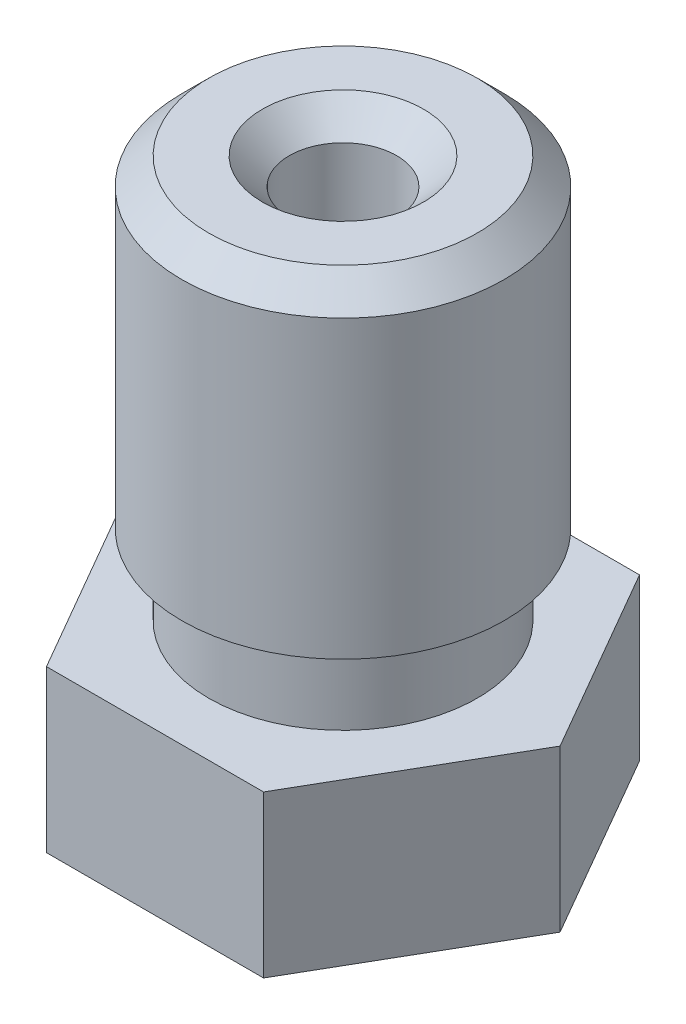
ISO-10303-21;
HEADER;
FILE_DESCRIPTION(('STEP AP214'),'2;1');
FILE_NAME('part.step','',(''),(''),'','','');
FILE_SCHEMA(('AUTOMOTIVE_DESIGN { 1 0 10303 214 1 1 1 1 }'));
ENDSEC;
DATA;
#1=APPLICATION_CONTEXT('core data for automotive mechanical design processes');
#2=APPLICATION_PROTOCOL_DEFINITION('international standard','automotive_design',2000,#1);
#3=PRODUCT_CONTEXT('',#1,'mechanical');
#4=PRODUCT('Part','Part','',(#3));
#5=PRODUCT_RELATED_PRODUCT_CATEGORY('part','',(#4));
#6=PRODUCT_DEFINITION_FORMATION('','',#4);
#7=PRODUCT_DEFINITION_CONTEXT('part definition',#1,'design');
#8=PRODUCT_DEFINITION('design','',#6,#7);
#9=PRODUCT_DEFINITION_SHAPE('','',#8);
#10=(LENGTH_UNIT() NAMED_UNIT(*) SI_UNIT(.MILLI.,.METRE.));
#11=(NAMED_UNIT(*) PLANE_ANGLE_UNIT() SI_UNIT($,.RADIAN.));
#12=(NAMED_UNIT(*) SI_UNIT($,.STERADIAN.) SOLID_ANGLE_UNIT());
#13=UNCERTAINTY_MEASURE_WITH_UNIT(LENGTH_MEASURE(1.E-05),#10,'distance_accuracy_value','');
#14=(GEOMETRIC_REPRESENTATION_CONTEXT(3) GLOBAL_UNCERTAINTY_ASSIGNED_CONTEXT((#13)) GLOBAL_UNIT_ASSIGNED_CONTEXT((#10,
#11,#12)) REPRESENTATION_CONTEXT('',''));
#15=CARTESIAN_POINT('',(0.,0.,0.));
#16=DIRECTION('',(0.,0.,1.));
#17=DIRECTION('',(1.,0.,0.));
#18=AXIS2_PLACEMENT_3D('',#15,#16,#17);
#19=CARTESIAN_POINT('',(2.02072594216369,3.,3.5));
#20=DIRECTION('',(0.,0.,1.));
#21=DIRECTION('',(1.,0.,0.));
#22=AXIS2_PLACEMENT_3D('',#19,#20,#21);
#23=PLANE('',#22);
#24=DIRECTION('',(-1.,0.,0.));
#25=VECTOR('',#24,1.);
#26=CARTESIAN_POINT('',(2.02072594216369,0.,3.5));
#27=LINE('',#26,#25);
#28=CARTESIAN_POINT('',(2.02072594216369,0.,3.5));
#29=VERTEX_POINT('',#28);
#30=CARTESIAN_POINT('',(-2.02072594216369,0.,3.5));
#31=VERTEX_POINT('',#30);
#32=EDGE_CURVE('E121',#29,#31,#27,.T.);
#33=ORIENTED_EDGE('',*,*,#32,.F.);
#34=DIRECTION('',(0.,-1.,0.));
#35=VECTOR('',#34,1.);
#36=CARTESIAN_POINT('',(2.02072594216369,3.,3.5));
#37=LINE('',#36,#35);
#38=CARTESIAN_POINT('',(2.02072594216369,3.,3.5));
#39=VERTEX_POINT('',#38);
#40=EDGE_CURVE('E50',#39,#29,#37,.T.);
#41=ORIENTED_EDGE('',*,*,#40,.F.);
#42=DIRECTION('',(-1.,0.,0.));
#43=VECTOR('',#42,1.);
#44=CARTESIAN_POINT('',(2.02072594216369,3.,3.5));
#45=LINE('',#44,#43);
#46=CARTESIAN_POINT('',(-2.02072594216369,3.,3.5));
#47=VERTEX_POINT('',#46);
#48=EDGE_CURVE('E137',#39,#47,#45,.T.);
#49=ORIENTED_EDGE('',*,*,#48,.T.);
#50=DIRECTION('',(0.,-1.,0.));
#51=VECTOR('',#50,1.);
#52=CARTESIAN_POINT('',(-2.02072594216369,3.,3.5));
#53=LINE('',#52,#51);
#54=EDGE_CURVE('E85',#47,#31,#53,.T.);
#55=ORIENTED_EDGE('',*,*,#54,.T.);
#56=EDGE_LOOP('',(#33,#41,#49,#55));
#57=FACE_BOUND('',#56,.T.);
#58=ADVANCED_FACE('F33',(#57),#23,.T.);
#59=CARTESIAN_POINT('',(4.04145188432738,3.,0.));
#60=DIRECTION('',(0.866025403784439,0.,0.5));
#61=DIRECTION('',(0.5,0.,-0.866025403784439));
#62=AXIS2_PLACEMENT_3D('',#59,#60,#61);
#63=PLANE('',#62);
#64=DIRECTION('',(-0.5,0.,0.866025403784439));
#65=VECTOR('',#64,1.);
#66=CARTESIAN_POINT('',(4.04145188432738,0.,0.));
#67=LINE('',#66,#65);
#68=CARTESIAN_POINT('',(4.04145188432738,0.,0.));
#69=VERTEX_POINT('',#68);
#70=EDGE_CURVE('E134',#69,#29,#67,.T.);
#71=ORIENTED_EDGE('',*,*,#70,.F.);
#72=DIRECTION('',(0.,-1.,0.));
#73=VECTOR('',#72,1.);
#74=CARTESIAN_POINT('',(4.04145188432738,3.,0.));
#75=LINE('',#74,#73);
#76=CARTESIAN_POINT('',(4.04145188432738,3.,0.));
#77=VERTEX_POINT('',#76);
#78=EDGE_CURVE('E73',#77,#69,#75,.T.);
#79=ORIENTED_EDGE('',*,*,#78,.F.);
#80=DIRECTION('',(-0.5,0.,0.866025403784439));
#81=VECTOR('',#80,1.);
#82=CARTESIAN_POINT('',(4.04145188432738,3.,0.));
#83=LINE('',#82,#81);
#84=EDGE_CURVE('E111',#77,#39,#83,.T.);
#85=ORIENTED_EDGE('',*,*,#84,.T.);
#86=ORIENTED_EDGE('',*,*,#40,.T.);
#87=EDGE_LOOP('',(#71,#79,#85,#86));
#88=FACE_BOUND('',#87,.T.);
#89=ADVANCED_FACE('F210',(#88),#63,.T.);
#90=CARTESIAN_POINT('',(2.02072594216369,3.,-3.5));
#91=DIRECTION('',(0.866025403784438,0.,-0.500000000000001));
#92=DIRECTION('',(-0.500000000000001,0.,-0.866025403784438));
#93=AXIS2_PLACEMENT_3D('',#90,#91,#92);
#94=PLANE('',#93);
#95=DIRECTION('',(0.500000000000001,0.,0.866025403784438));
#96=VECTOR('',#95,1.);
#97=CARTESIAN_POINT('',(2.02072594216369,0.,-3.5));
#98=LINE('',#97,#96);
#99=CARTESIAN_POINT('',(2.02072594216369,0.,-3.5));
#100=VERTEX_POINT('',#99);
#101=EDGE_CURVE('E98',#100,#69,#98,.T.);
#102=ORIENTED_EDGE('',*,*,#101,.F.);
#103=DIRECTION('',(0.,-1.,0.));
#104=VECTOR('',#103,1.);
#105=CARTESIAN_POINT('',(2.02072594216369,3.,-3.5));
#106=LINE('',#105,#104);
#107=CARTESIAN_POINT('',(2.02072594216369,3.,-3.5));
#108=VERTEX_POINT('',#107);
#109=EDGE_CURVE('E93',#108,#100,#106,.T.);
#110=ORIENTED_EDGE('',*,*,#109,.F.);
#111=DIRECTION('',(0.500000000000001,0.,0.866025403784438));
#112=VECTOR('',#111,1.);
#113=CARTESIAN_POINT('',(2.02072594216369,3.,-3.5));
#114=LINE('',#113,#112);
#115=EDGE_CURVE('E96',#108,#77,#114,.T.);
#116=ORIENTED_EDGE('',*,*,#115,.T.);
#117=ORIENTED_EDGE('',*,*,#78,.T.);
#118=EDGE_LOOP('',(#102,#110,#116,#117));
#119=FACE_BOUND('',#118,.T.);
#120=ADVANCED_FACE('F95',(#119),#94,.T.);
#121=CARTESIAN_POINT('',(-2.02072594216369,3.,-3.5));
#122=DIRECTION('',(0.,0.,-1.));
#123=DIRECTION('',(-1.,0.,0.));
#124=AXIS2_PLACEMENT_3D('',#121,#122,#123);
#125=PLANE('',#124);
#126=DIRECTION('',(1.,0.,0.));
#127=VECTOR('',#126,1.);
#128=CARTESIAN_POINT('',(-2.02072594216369,0.,-3.5));
#129=LINE('',#128,#127);
#130=CARTESIAN_POINT('',(-2.02072594216369,0.,-3.5));
#131=VERTEX_POINT('',#130);
#132=EDGE_CURVE('E131',#131,#100,#129,.T.);
#133=ORIENTED_EDGE('',*,*,#132,.F.);
#134=DIRECTION('',(0.,-1.,0.));
#135=VECTOR('',#134,1.);
#136=CARTESIAN_POINT('',(-2.02072594216369,3.,-3.5));
#137=LINE('',#136,#135);
#138=CARTESIAN_POINT('',(-2.02072594216369,3.,-3.5));
#139=VERTEX_POINT('',#138);
#140=EDGE_CURVE('E103',#139,#131,#137,.T.);
#141=ORIENTED_EDGE('',*,*,#140,.F.);
#142=DIRECTION('',(1.,0.,0.));
#143=VECTOR('',#142,1.);
#144=CARTESIAN_POINT('',(-2.02072594216369,3.,-3.5));
#145=LINE('',#144,#143);
#146=EDGE_CURVE('E109',#139,#108,#145,.T.);
#147=ORIENTED_EDGE('',*,*,#146,.T.);
#148=ORIENTED_EDGE('',*,*,#109,.T.);
#149=EDGE_LOOP('',(#133,#141,#147,#148));
#150=FACE_BOUND('',#149,.T.);
#151=ADVANCED_FACE('F113',(#150),#125,.T.);
#152=CARTESIAN_POINT('',(-4.04145188432738,3.,0.));
#153=DIRECTION('',(-0.866025403784439,0.,-0.5));
#154=DIRECTION('',(-0.5,0.,0.866025403784439));
#155=AXIS2_PLACEMENT_3D('',#152,#153,#154);
#156=PLANE('',#155);
#157=DIRECTION('',(0.5,0.,-0.866025403784439));
#158=VECTOR('',#157,1.);
#159=CARTESIAN_POINT('',(-4.04145188432738,0.,0.));
#160=LINE('',#159,#158);
#161=CARTESIAN_POINT('',(-4.04145188432738,0.,0.));
#162=VERTEX_POINT('',#161);
#163=EDGE_CURVE('E128',#162,#131,#160,.T.);
#164=ORIENTED_EDGE('',*,*,#163,.F.);
#165=DIRECTION('',(0.,-1.,0.));
#166=VECTOR('',#165,1.);
#167=CARTESIAN_POINT('',(-4.04145188432738,3.,0.));
#168=LINE('',#167,#166);
#169=CARTESIAN_POINT('',(-4.04145188432738,3.,0.));
#170=VERTEX_POINT('',#169);
#171=EDGE_CURVE('E142',#170,#162,#168,.T.);
#172=ORIENTED_EDGE('',*,*,#171,.F.);
#173=DIRECTION('',(0.5,0.,-0.866025403784439));
#174=VECTOR('',#173,1.);
#175=CARTESIAN_POINT('',(-4.04145188432738,3.,0.));
#176=LINE('',#175,#174);
#177=EDGE_CURVE('E114',#170,#139,#176,.T.);
#178=ORIENTED_EDGE('',*,*,#177,.T.);
#179=ORIENTED_EDGE('',*,*,#140,.T.);
#180=EDGE_LOOP('',(#164,#172,#178,#179));
#181=FACE_BOUND('',#180,.T.);
#182=ADVANCED_FACE('F224',(#181),#156,.T.);
#183=CARTESIAN_POINT('',(-2.02072594216369,3.,3.5));
#184=DIRECTION('',(-0.866025403784439,0.,0.5));
#185=DIRECTION('',(0.5,0.,0.866025403784439));
#186=AXIS2_PLACEMENT_3D('',#183,#184,#185);
#187=PLANE('',#186);
#188=DIRECTION('',(-0.5,0.,-0.866025403784439));
#189=VECTOR('',#188,1.);
#190=CARTESIAN_POINT('',(-2.02072594216369,0.,3.5));
#191=LINE('',#190,#189);
#192=EDGE_CURVE('E124',#31,#162,#191,.T.);
#193=ORIENTED_EDGE('',*,*,#192,.F.);
#194=ORIENTED_EDGE('',*,*,#54,.F.);
#195=DIRECTION('',(-0.5,0.,-0.866025403784439));
#196=VECTOR('',#195,1.);
#197=CARTESIAN_POINT('',(-2.02072594216369,3.,3.5));
#198=LINE('',#197,#196);
#199=EDGE_CURVE('E116',#47,#170,#198,.T.);
#200=ORIENTED_EDGE('',*,*,#199,.T.);
#201=ORIENTED_EDGE('',*,*,#171,.T.);
#202=EDGE_LOOP('',(#193,#194,#200,#201));
#203=FACE_BOUND('',#202,.T.);
#204=ADVANCED_FACE('F206',(#203),#187,.T.);
#205=CARTESIAN_POINT('',(0.,3.,0.));
#206=DIRECTION('',(0.,-1.,0.));
#207=DIRECTION('',(0.,0.,-1.));
#208=AXIS2_PLACEMENT_3D('',#205,#206,#207);
#209=PLANE('',#208);
#210=CARTESIAN_POINT('',(0.,3.,0.));
#211=DIRECTION('',(0.,1.,0.));
#212=DIRECTION('',(0.,0.,1.));
#213=AXIS2_PLACEMENT_3D('',#210,#211,#212);
#214=CIRCLE('',#213,2.5);
#215=CARTESIAN_POINT('',(0.,3.,2.5));
#216=VERTEX_POINT('',#215);
#217=EDGE_CURVE('E125',#216,#216,#214,.T.);
#218=ORIENTED_EDGE('',*,*,#217,.F.);
#219=EDGE_LOOP('',(#218));
#220=FACE_BOUND('',#219,.T.);
#221=ORIENTED_EDGE('',*,*,#48,.F.);
#222=ORIENTED_EDGE('',*,*,#84,.F.);
#223=ORIENTED_EDGE('',*,*,#115,.F.);
#224=ORIENTED_EDGE('',*,*,#146,.F.);
#225=ORIENTED_EDGE('',*,*,#177,.F.);
#226=ORIENTED_EDGE('',*,*,#199,.F.);
#227=EDGE_LOOP('',(#221,#222,#223,#224,#225,#226));
#228=FACE_BOUND('',#227,.T.);
#229=ADVANCED_FACE('F107',(#220,#228),#209,.F.);
#230=CARTESIAN_POINT('',(0.,0.,0.));
#231=DIRECTION('',(0.,-1.,0.));
#232=DIRECTION('',(0.,0.,-1.));
#233=AXIS2_PLACEMENT_3D('',#230,#231,#232);
#234=PLANE('',#233);
#235=CARTESIAN_POINT('',(0.,0.,0.));
#236=DIRECTION('',(0.,-1.,0.));
#237=DIRECTION('',(0.,0.,-1.));
#238=AXIS2_PLACEMENT_3D('',#235,#236,#237);
#239=CIRCLE('',#238,2.50000000004502);
#240=CARTESIAN_POINT('',(0.,0.,-2.50000000004502));
#241=VERTEX_POINT('',#240);
#242=EDGE_CURVE('E139',#241,#241,#239,.T.);
#243=ORIENTED_EDGE('',*,*,#242,.F.);
#244=EDGE_LOOP('',(#243));
#245=FACE_BOUND('',#244,.T.);
#246=ORIENTED_EDGE('',*,*,#32,.T.);
#247=ORIENTED_EDGE('',*,*,#192,.T.);
#248=ORIENTED_EDGE('',*,*,#163,.T.);
#249=ORIENTED_EDGE('',*,*,#132,.T.);
#250=ORIENTED_EDGE('',*,*,#101,.T.);
#251=ORIENTED_EDGE('',*,*,#70,.T.);
#252=EDGE_LOOP('',(#246,#247,#248,#249,#250,#251));
#253=FACE_BOUND('',#252,.T.);
#254=ADVANCED_FACE('F209',(#245,#253),#234,.T.);
#255=CARTESIAN_POINT('',(0.,3.,0.));
#256=DIRECTION('',(0.,1.,0.));
#257=DIRECTION('',(0.,0.,1.));
#258=AXIS2_PLACEMENT_3D('',#255,#256,#257);
#259=CYLINDRICAL_SURFACE('',#258,2.5);
#260=ORIENTED_EDGE('',*,*,#217,.T.);
#261=EDGE_LOOP('',(#260));
#262=FACE_BOUND('',#261,.T.);
#263=CARTESIAN_POINT('',(0.,4.5,0.));
#264=DIRECTION('',(0.,1.,0.));
#265=DIRECTION('',(0.,0.,1.));
#266=AXIS2_PLACEMENT_3D('',#263,#264,#265);
#267=CIRCLE('',#266,2.5);
#268=CARTESIAN_POINT('',(0.,4.5,2.5));
#269=VERTEX_POINT('',#268);
#270=EDGE_CURVE('E198',#269,#269,#267,.T.);
#271=ORIENTED_EDGE('',*,*,#270,.F.);
#272=EDGE_LOOP('',(#271));
#273=FACE_BOUND('',#272,.T.);
#274=ADVANCED_FACE('F167',(#262,#273),#259,.T.);
#275=CARTESIAN_POINT('',(0.,10.5,0.));
#276=DIRECTION('',(0.,1.,0.));
#277=DIRECTION('',(0.,0.,1.));
#278=AXIS2_PLACEMENT_3D('',#275,#276,#277);
#279=PLANE('',#278);
#280=CARTESIAN_POINT('',(0.,10.5,0.));
#281=DIRECTION('',(0.,1.,0.));
#282=DIRECTION('',(0.,0.,1.));
#283=AXIS2_PLACEMENT_3D('',#280,#281,#282);
#284=CIRCLE('',#283,2.4999999999834);
#285=CARTESIAN_POINT('',(0.,10.5,2.4999999999834));
#286=VERTEX_POINT('',#285);
#287=EDGE_CURVE('E150',#286,#286,#284,.T.);
#288=ORIENTED_EDGE('',*,*,#287,.T.);
#289=EDGE_LOOP('',(#288));
#290=FACE_BOUND('',#289,.T.);
#291=CARTESIAN_POINT('',(-1.10963134903613E-11,10.5,0.));
#292=DIRECTION('',(0.,1.,0.));
#293=DIRECTION('',(0.,0.,1.));
#294=AXIS2_PLACEMENT_3D('',#291,#292,#293);
#295=CIRCLE('',#294,1.5000000000277);
#296=CARTESIAN_POINT('',(-1.10963134903613E-11,10.5,1.5000000000277));
#297=VERTEX_POINT('',#296);
#298=EDGE_CURVE('E147',#297,#297,#295,.F.);
#299=ORIENTED_EDGE('',*,*,#298,.T.);
#300=EDGE_LOOP('',(#299));
#301=FACE_BOUND('',#300,.T.);
#302=ADVANCED_FACE('F164',(#290,#301),#279,.T.);
#303=CARTESIAN_POINT('',(0.,3.,0.));
#304=DIRECTION('',(0.,1.,0.));
#305=DIRECTION('',(0.,0.,1.));
#306=AXIS2_PLACEMENT_3D('',#303,#304,#305);
#307=CYLINDRICAL_SURFACE('',#306,3.);
#308=CARTESIAN_POINT('',(0.,9.9999999999834,0.));
#309=DIRECTION('',(0.,1.,0.));
#310=DIRECTION('',(0.,0.,1.));
#311=AXIS2_PLACEMENT_3D('',#308,#309,#310);
#312=CIRCLE('',#311,3.);
#313=CARTESIAN_POINT('',(0.,9.9999999999834,3.));
#314=VERTEX_POINT('',#313);
#315=EDGE_CURVE('E42',#314,#314,#312,.F.);
#316=ORIENTED_EDGE('',*,*,#315,.T.);
#317=EDGE_LOOP('',(#316));
#318=FACE_BOUND('',#317,.T.);
#319=CARTESIAN_POINT('',(0.,4.5,0.));
#320=DIRECTION('',(0.,1.,0.));
#321=DIRECTION('',(0.,0.,1.));
#322=AXIS2_PLACEMENT_3D('',#319,#320,#321);
#323=CIRCLE('',#322,3.);
#324=CARTESIAN_POINT('',(0.,4.5,3.));
#325=VERTEX_POINT('',#324);
#326=EDGE_CURVE('E201',#325,#325,#323,.T.);
#327=ORIENTED_EDGE('',*,*,#326,.T.);
#328=EDGE_LOOP('',(#327));
#329=FACE_BOUND('',#328,.T.);
#330=ADVANCED_FACE('F155',(#318,#329),#307,.T.);
#331=CARTESIAN_POINT('',(3.,4.5,0.));
#332=DIRECTION('',(0.,-1.,0.));
#333=DIRECTION('',(0.,0.,-1.));
#334=AXIS2_PLACEMENT_3D('',#331,#332,#333);
#335=PLANE('',#334);
#336=ORIENTED_EDGE('',*,*,#270,.T.);
#337=EDGE_LOOP('',(#336));
#338=FACE_BOUND('',#337,.T.);
#339=ORIENTED_EDGE('',*,*,#326,.F.);
#340=EDGE_LOOP('',(#339));
#341=FACE_BOUND('',#340,.T.);
#342=ADVANCED_FACE('F244',(#338,#341),#335,.T.);
#343=CARTESIAN_POINT('',(0.,-2.,0.));
#344=DIRECTION('',(0.,1.,0.));
#345=DIRECTION('',(-1.,0.,0.));
#346=AXIS2_PLACEMENT_3D('',#343,#344,#345);
#347=CONICAL_SURFACE('',#346,0.50000000004502,0.785398163397449);
#348=ORIENTED_EDGE('',*,*,#242,.T.);
#349=EDGE_LOOP('',(#348));
#350=FACE_BOUND('',#349,.T.);
#351=CARTESIAN_POINT('',(0.,-2.,0.));
#352=DIRECTION('',(0.,-1.,0.));
#353=DIRECTION('',(1.,0.,0.));
#354=AXIS2_PLACEMENT_3D('',#351,#352,#353);
#355=CIRCLE('',#354,0.50000000004502);
#356=CARTESIAN_POINT('',(0.50000000004502,-2.,0.));
#357=VERTEX_POINT('',#356);
#358=EDGE_CURVE('E189',#357,#357,#355,.T.);
#359=ORIENTED_EDGE('',*,*,#358,.F.);
#360=EDGE_LOOP('',(#359));
#361=FACE_BOUND('',#360,.T.);
#362=ADVANCED_FACE('F247',(#350,#361),#347,.T.);
#363=CARTESIAN_POINT('',(0.,-2.,0.));
#364=DIRECTION('',(0.,-1.,0.));
#365=DIRECTION('',(1.,0.,0.));
#366=AXIS2_PLACEMENT_3D('',#363,#364,#365);
#367=PLANE('',#366);
#368=CARTESIAN_POINT('',(-1.10963134903613E-11,-2.,0.));
#369=DIRECTION('',(0.,1.,0.));
#370=DIRECTION('',(0.,0.,1.));
#371=AXIS2_PLACEMENT_3D('',#368,#369,#370);
#372=CIRCLE('',#371,0.0499999999999996);
#373=CARTESIAN_POINT('',(-1.10963134903613E-11,-2.,0.0499999999999996));
#374=VERTEX_POINT('',#373);
#375=EDGE_CURVE('E185',#374,#374,#372,.T.);
#376=ORIENTED_EDGE('',*,*,#375,.T.);
#377=EDGE_LOOP('',(#376));
#378=FACE_BOUND('',#377,.T.);
#379=ORIENTED_EDGE('',*,*,#358,.T.);
#380=EDGE_LOOP('',(#379));
#381=FACE_BOUND('',#380,.T.);
#382=ADVANCED_FACE('F251',(#378,#381),#367,.T.);
#383=CARTESIAN_POINT('',(-1.10963134903613E-11,-2.,0.));
#384=DIRECTION('',(0.,1.,0.));
#385=DIRECTION('',(0.,0.,1.));
#386=AXIS2_PLACEMENT_3D('',#383,#384,#385);
#387=CYLINDRICAL_SURFACE('',#386,0.0499999999999997);
#388=ORIENTED_EDGE('',*,*,#375,.F.);
#389=EDGE_LOOP('',(#388));
#390=FACE_BOUND('',#389,.T.);
#391=CARTESIAN_POINT('',(-1.10963134903613E-11,-1.20000000003984,0.));
#392=DIRECTION('',(0.,1.,0.));
#393=DIRECTION('',(0.,0.,1.));
#394=AXIS2_PLACEMENT_3D('',#391,#392,#393);
#395=CIRCLE('',#394,0.0499999999999997);
#396=CARTESIAN_POINT('',(-1.10963134903613E-11,-1.20000000003984,0.0499999999999997));
#397=VERTEX_POINT('',#396);
#398=EDGE_CURVE('E273',#397,#397,#395,.T.);
#399=ORIENTED_EDGE('',*,*,#398,.T.);
#400=EDGE_LOOP('',(#399));
#401=FACE_BOUND('',#400,.T.);
#402=ADVANCED_FACE('F179',(#390,#401),#387,.F.);
#403=CARTESIAN_POINT('',(-1.10963134903613E-11,-2.,0.));
#404=DIRECTION('',(0.,1.,0.));
#405=DIRECTION('',(0.,0.,1.));
#406=AXIS2_PLACEMENT_3D('',#403,#404,#405);
#407=CYLINDRICAL_SURFACE('',#406,1.0000000000111);
#408=CARTESIAN_POINT('',(-1.10963134903613E-11,9.9999999999834,0.));
#409=DIRECTION('',(0.,1.,0.));
#410=DIRECTION('',(0.,0.,1.));
#411=AXIS2_PLACEMENT_3D('',#408,#409,#410);
#412=CIRCLE('',#411,1.0000000000111);
#413=CARTESIAN_POINT('',(-1.10963134903613E-11,9.9999999999834,1.0000000000111));
#414=VERTEX_POINT('',#413);
#415=EDGE_CURVE('E11',#414,#414,#412,.T.);
#416=ORIENTED_EDGE('',*,*,#415,.T.);
#417=EDGE_LOOP('',(#416));
#418=FACE_BOUND('',#417,.T.);
#419=CARTESIAN_POINT('',(-1.10963134903613E-11,0.,0.));
#420=DIRECTION('',(0.,1.,0.));
#421=DIRECTION('',(0.,0.,1.));
#422=AXIS2_PLACEMENT_3D('',#419,#420,#421);
#423=CIRCLE('',#422,1.0000000000111);
#424=CARTESIAN_POINT('',(-1.10963134903613E-11,0.,1.0000000000111));
#425=VERTEX_POINT('',#424);
#426=EDGE_CURVE('E183',#425,#425,#423,.T.);
#427=ORIENTED_EDGE('',*,*,#426,.F.);
#428=EDGE_LOOP('',(#427));
#429=FACE_BOUND('',#428,.T.);
#430=ADVANCED_FACE('F175',(#418,#429),#407,.F.);
#431=CARTESIAN_POINT('',(-1.10963134903613E-11,0.,0.));
#432=DIRECTION('',(0.,1.,0.));
#433=DIRECTION('',(0.,0.,1.));
#434=AXIS2_PLACEMENT_3D('',#431,#432,#433);
#435=CONICAL_SURFACE('',#434,1.0000000000111,0.832981266710198);
#436=CARTESIAN_POINT('',(-1.10963134903613E-11,-0.227272727272521,0.));
#437=DIRECTION('',(0.,1.,0.));
#438=DIRECTION('',(0.,0.,1.));
#439=AXIS2_PLACEMENT_3D('',#436,#437,#438);
#440=CIRCLE('',#439,0.749999999993361);
#441=CARTESIAN_POINT('',(-1.10963134903613E-11,-0.227272727272521,0.749999999993361));
#442=VERTEX_POINT('',#441);
#443=EDGE_CURVE('E186',#442,#442,#440,.T.);
#444=ORIENTED_EDGE('',*,*,#443,.F.);
#445=EDGE_LOOP('',(#444));
#446=FACE_BOUND('',#445,.T.);
#447=ORIENTED_EDGE('',*,*,#426,.T.);
#448=EDGE_LOOP('',(#447));
#449=FACE_BOUND('',#448,.T.);
#450=ADVANCED_FACE('F178',(#446,#449),#435,.F.);
#451=CARTESIAN_POINT('',(-1.10963134903613E-11,-2.,0.));
#452=DIRECTION('',(0.,1.,0.));
#453=DIRECTION('',(0.,0.,1.));
#454=AXIS2_PLACEMENT_3D('',#451,#452,#453);
#455=CYLINDRICAL_SURFACE('',#454,0.749999999993361);
#456=CARTESIAN_POINT('',(-1.10963134903613E-11,-0.700000000000002,0.));
#457=DIRECTION('',(0.,1.,0.));
#458=DIRECTION('',(0.,0.,1.));
#459=AXIS2_PLACEMENT_3D('',#456,#457,#458);
#460=CIRCLE('',#459,0.749999999993361);
#461=CARTESIAN_POINT('',(-1.10963134903613E-11,-0.700000000000002,0.749999999993361));
#462=VERTEX_POINT('',#461);
#463=EDGE_CURVE('E192',#462,#462,#460,.T.);
#464=ORIENTED_EDGE('',*,*,#463,.F.);
#465=EDGE_LOOP('',(#464));
#466=FACE_BOUND('',#465,.T.);
#467=ORIENTED_EDGE('',*,*,#443,.T.);
#468=EDGE_LOOP('',(#467));
#469=FACE_BOUND('',#468,.T.);
#470=ADVANCED_FACE('F261',(#466,#469),#455,.F.);
#471=CARTESIAN_POINT('',(-1.10963134903613E-11,-0.700000000000002,0.));
#472=DIRECTION('',(0.,1.,0.));
#473=DIRECTION('',(0.,0.,1.));
#474=AXIS2_PLACEMENT_3D('',#471,#472,#473);
#475=CONICAL_SURFACE('',#474,0.749999999993361,0.950546840769909);
#476=ORIENTED_EDGE('',*,*,#398,.F.);
#477=EDGE_LOOP('',(#476));
#478=FACE_BOUND('',#477,.T.);
#479=ORIENTED_EDGE('',*,*,#463,.T.);
#480=EDGE_LOOP('',(#479));
#481=FACE_BOUND('',#480,.T.);
#482=ADVANCED_FACE('F161',(#478,#481),#475,.F.);
#483=CARTESIAN_POINT('',(0.,10.5,0.));
#484=DIRECTION('',(0.,-1.,0.));
#485=DIRECTION('',(0.,0.,-1.));
#486=AXIS2_PLACEMENT_3D('',#483,#484,#485);
#487=CONICAL_SURFACE('',#486,2.4999999999834,0.785398163397446);
#488=ORIENTED_EDGE('',*,*,#315,.F.);
#489=EDGE_LOOP('',(#488));
#490=FACE_BOUND('',#489,.T.);
#491=ORIENTED_EDGE('',*,*,#287,.F.);
#492=EDGE_LOOP('',(#491));
#493=FACE_BOUND('',#492,.T.);
#494=ADVANCED_FACE('F158',(#490,#493),#487,.T.);
#495=CARTESIAN_POINT('',(-1.10963134903613E-11,9.9999999999834,0.));
#496=DIRECTION('',(0.,1.,0.));
#497=DIRECTION('',(0.,0.,1.));
#498=AXIS2_PLACEMENT_3D('',#495,#496,#497);
#499=CONICAL_SURFACE('',#498,1.0000000000111,0.785398163397452);
#500=ORIENTED_EDGE('',*,*,#298,.F.);
#501=EDGE_LOOP('',(#500));
#502=FACE_BOUND('',#501,.T.);
#503=ORIENTED_EDGE('',*,*,#415,.F.);
#504=EDGE_LOOP('',(#503));
#505=FACE_BOUND('',#504,.T.);
#506=ADVANCED_FACE('F35',(#502,#505),#499,.F.);
#507=CLOSED_SHELL('',(#58,#89,#120,#151,#182,#204,#229,#254,#274,#302,#330,#342,#362,#382,#402,
#430,#450,#470,#482,#494,#506));
#508=MANIFOLD_SOLID_BREP('B2',#507);
#509=ADVANCED_BREP_SHAPE_REPRESENTATION('',(#18,#508),#14);
#510=SHAPE_DEFINITION_REPRESENTATION(#9,#509);
ENDSEC;
END-ISO-10303-21;
